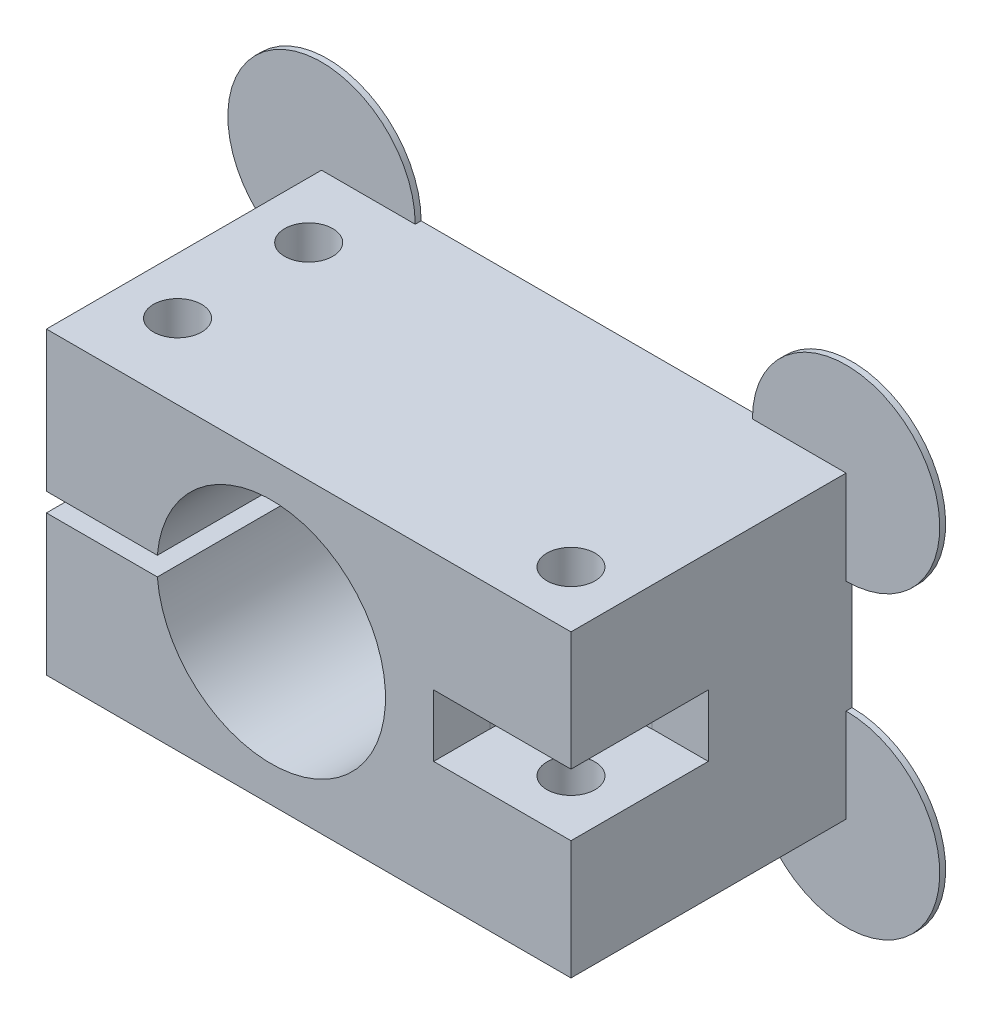
ISO-10303-21;
HEADER;
FILE_DESCRIPTION(('STEP AP214'),'2;1');
FILE_NAME('part.step','',(''),(''),'','','');
FILE_SCHEMA(('AUTOMOTIVE_DESIGN { 1 0 10303 214 1 1 1 1 }'));
ENDSEC;
DATA;
#1=APPLICATION_CONTEXT('core data for automotive mechanical design processes');
#2=APPLICATION_PROTOCOL_DEFINITION('international standard','automotive_design',2000,#1);
#3=PRODUCT_CONTEXT('',#1,'mechanical');
#4=PRODUCT('Part','Part','',(#3));
#5=PRODUCT_RELATED_PRODUCT_CATEGORY('part','',(#4));
#6=PRODUCT_DEFINITION_FORMATION('','',#4);
#7=PRODUCT_DEFINITION_CONTEXT('part definition',#1,'design');
#8=PRODUCT_DEFINITION('design','',#6,#7);
#9=PRODUCT_DEFINITION_SHAPE('','',#8);
#10=(LENGTH_UNIT() NAMED_UNIT(*) SI_UNIT(.MILLI.,.METRE.));
#11=(NAMED_UNIT(*) PLANE_ANGLE_UNIT() SI_UNIT($,.RADIAN.));
#12=(NAMED_UNIT(*) SI_UNIT($,.STERADIAN.) SOLID_ANGLE_UNIT());
#13=UNCERTAINTY_MEASURE_WITH_UNIT(LENGTH_MEASURE(1.E-05),#10,'distance_accuracy_value','');
#14=(GEOMETRIC_REPRESENTATION_CONTEXT(3) GLOBAL_UNCERTAINTY_ASSIGNED_CONTEXT((#13)) GLOBAL_UNIT_ASSIGNED_CONTEXT((#10,
#11,#12)) REPRESENTATION_CONTEXT('',''));
#15=CARTESIAN_POINT('',(0.,0.,0.));
#16=DIRECTION('',(0.,0.,1.));
#17=DIRECTION('',(1.,0.,0.));
#18=AXIS2_PLACEMENT_3D('',#15,#16,#17);
#19=CARTESIAN_POINT('',(20.32,-10.16,19.05));
#20=DIRECTION('',(-1.,0.,0.));
#21=DIRECTION('',(0.,0.,1.));
#22=AXIS2_PLACEMENT_3D('',#19,#20,#21);
#23=PLANE('',#22);
#24=DIRECTION('',(0.,1.,0.));
#25=VECTOR('',#24,1.);
#26=CARTESIAN_POINT('',(20.32,-10.16,0.));
#27=LINE('',#26,#25);
#28=CARTESIAN_POINT('',(20.32,-3.81,0.));
#29=VERTEX_POINT('',#28);
#30=CARTESIAN_POINT('',(20.32,3.80999999999999,0.));
#31=VERTEX_POINT('',#30);
#32=EDGE_CURVE('E186',#29,#31,#27,.T.);
#33=ORIENTED_EDGE('',*,*,#32,.T.);
#34=DIRECTION('',(0.,0.,-1.));
#35=VECTOR('',#34,1.);
#36=CARTESIAN_POINT('',(20.32,3.80999999999999,0.4));
#37=LINE('',#36,#35);
#38=CARTESIAN_POINT('',(20.32,3.80999999999999,0.400000000000001));
#39=VERTEX_POINT('',#38);
#40=EDGE_CURVE('E196',#31,#39,#37,.F.);
#41=ORIENTED_EDGE('',*,*,#40,.T.);
#42=DIRECTION('',(0.,-1.,0.));
#43=VECTOR('',#42,1.);
#44=CARTESIAN_POINT('',(20.32,-10.16,0.400000000000001));
#45=LINE('',#44,#43);
#46=CARTESIAN_POINT('',(20.32,10.16,0.400000000000008));
#47=VERTEX_POINT('',#46);
#48=EDGE_CURVE('E207',#47,#39,#45,.T.);
#49=ORIENTED_EDGE('',*,*,#48,.F.);
#50=DIRECTION('',(0.,0.,-1.));
#51=VECTOR('',#50,1.);
#52=CARTESIAN_POINT('',(20.32,10.16,19.05));
#53=LINE('',#52,#51);
#54=CARTESIAN_POINT('',(20.32,10.16,19.05));
#55=VERTEX_POINT('',#54);
#56=EDGE_CURVE('E338',#55,#47,#53,.T.);
#57=ORIENTED_EDGE('',*,*,#56,.F.);
#58=DIRECTION('',(0.,1.,0.));
#59=VECTOR('',#58,1.);
#60=CARTESIAN_POINT('',(20.32,-10.16,19.05));
#61=LINE('',#60,#59);
#62=CARTESIAN_POINT('',(20.32,2.1,19.05));
#63=VERTEX_POINT('',#62);
#64=EDGE_CURVE('E325',#63,#55,#61,.T.);
#65=ORIENTED_EDGE('',*,*,#64,.F.);
#66=DIRECTION('',(0.,0.,-1.));
#67=VECTOR('',#66,1.);
#68=CARTESIAN_POINT('',(20.32,2.1,19.05));
#69=LINE('',#68,#67);
#70=CARTESIAN_POINT('',(20.32,2.1,9.74));
#71=VERTEX_POINT('',#70);
#72=EDGE_CURVE('E286',#63,#71,#69,.T.);
#73=ORIENTED_EDGE('',*,*,#72,.T.);
#74=DIRECTION('',(0.,-1.,0.));
#75=VECTOR('',#74,1.);
#76=CARTESIAN_POINT('',(20.32,-10.16,9.74));
#77=LINE('',#76,#75);
#78=CARTESIAN_POINT('',(20.32,-2.1,9.74));
#79=VERTEX_POINT('',#78);
#80=EDGE_CURVE('E354',#71,#79,#77,.T.);
#81=ORIENTED_EDGE('',*,*,#80,.T.);
#82=DIRECTION('',(0.,0.,-1.));
#83=VECTOR('',#82,1.);
#84=CARTESIAN_POINT('',(20.32,-2.1,19.05));
#85=LINE('',#84,#83);
#86=CARTESIAN_POINT('',(20.32,-2.1,19.05));
#87=VERTEX_POINT('',#86);
#88=EDGE_CURVE('E290',#87,#79,#85,.T.);
#89=ORIENTED_EDGE('',*,*,#88,.F.);
#90=CARTESIAN_POINT('',(20.32,-10.16,19.05));
#91=VERTEX_POINT('',#90);
#92=EDGE_CURVE('E326',#91,#87,#61,.T.);
#93=ORIENTED_EDGE('',*,*,#92,.F.);
#94=DIRECTION('',(0.,0.,-1.));
#95=VECTOR('',#94,1.);
#96=CARTESIAN_POINT('',(20.32,-10.16,19.05));
#97=LINE('',#96,#95);
#98=CARTESIAN_POINT('',(20.32,-10.16,0.400000000000008));
#99=VERTEX_POINT('',#98);
#100=EDGE_CURVE('E340',#91,#99,#97,.T.);
#101=ORIENTED_EDGE('',*,*,#100,.T.);
#102=DIRECTION('',(0.,1.,0.));
#103=VECTOR('',#102,1.);
#104=CARTESIAN_POINT('',(20.32,-10.16,0.400000000000001));
#105=LINE('',#104,#103);
#106=CARTESIAN_POINT('',(20.32,-3.81,0.400000000000001));
#107=VERTEX_POINT('',#106);
#108=EDGE_CURVE('E220',#99,#107,#105,.T.);
#109=ORIENTED_EDGE('',*,*,#108,.T.);
#110=DIRECTION('',(0.,0.,-1.));
#111=VECTOR('',#110,1.);
#112=CARTESIAN_POINT('',(20.32,-3.81,0.4));
#113=LINE('',#112,#111);
#114=EDGE_CURVE('E218',#107,#29,#113,.T.);
#115=ORIENTED_EDGE('',*,*,#114,.T.);
#116=EDGE_LOOP('',(#33,#41,#49,#57,#65,#73,#81,#89,#93,#101,#109,#115));
#117=FACE_BOUND('',#116,.T.);
#118=ADVANCED_FACE('F33',(#117),#23,.F.);
#119=CARTESIAN_POINT('',(0.,0.,19.05));
#120=DIRECTION('',(0.,0.,-1.));
#121=DIRECTION('',(-1.,0.,0.));
#122=AXIS2_PLACEMENT_3D('',#119,#120,#121);
#123=PLANE('',#122);
#124=DIRECTION('',(1.,0.,0.));
#125=VECTOR('',#124,1.);
#126=CARTESIAN_POINT('',(0.,-2.1,19.05));
#127=LINE('',#126,#125);
#128=CARTESIAN_POINT('',(11.01,-2.1,19.05));
#129=VERTEX_POINT('',#128);
#130=EDGE_CURVE('E352',#129,#87,#127,.T.);
#131=ORIENTED_EDGE('',*,*,#130,.F.);
#132=DIRECTION('',(0.,1.,0.));
#133=VECTOR('',#132,1.);
#134=CARTESIAN_POINT('',(11.01,0.,19.05));
#135=LINE('',#134,#133);
#136=CARTESIAN_POINT('',(11.01,2.1,19.05));
#137=VERTEX_POINT('',#136);
#138=EDGE_CURVE('E349',#129,#137,#135,.T.);
#139=ORIENTED_EDGE('',*,*,#138,.T.);
#140=DIRECTION('',(1.,0.,0.));
#141=VECTOR('',#140,1.);
#142=CARTESIAN_POINT('',(0.,2.1,19.05));
#143=LINE('',#142,#141);
#144=EDGE_CURVE('E346',#137,#63,#143,.T.);
#145=ORIENTED_EDGE('',*,*,#144,.T.);
#146=ORIENTED_EDGE('',*,*,#64,.T.);
#147=DIRECTION('',(-1.,0.,0.));
#148=VECTOR('',#147,1.);
#149=CARTESIAN_POINT('',(-15.24,10.16,19.05));
#150=LINE('',#149,#148);
#151=CARTESIAN_POINT('',(-15.24,10.16,19.05));
#152=VERTEX_POINT('',#151);
#153=EDGE_CURVE('E329',#55,#152,#150,.T.);
#154=ORIENTED_EDGE('',*,*,#153,.T.);
#155=DIRECTION('',(0.,-1.,0.));
#156=VECTOR('',#155,1.);
#157=CARTESIAN_POINT('',(-15.24,-10.16,19.05));
#158=LINE('',#157,#156);
#159=CARTESIAN_POINT('',(-15.24,0.635,19.05));
#160=VERTEX_POINT('',#159);
#161=EDGE_CURVE('E320',#152,#160,#158,.T.);
#162=ORIENTED_EDGE('',*,*,#161,.T.);
#163=DIRECTION('',(-1.,0.,0.));
#164=VECTOR('',#163,1.);
#165=CARTESIAN_POINT('',(-15.2660684499861,0.635,19.05));
#166=LINE('',#165,#164);
#167=CARTESIAN_POINT('',(-7.7209315500139,0.635,19.05));
#168=VERTEX_POINT('',#167);
#169=EDGE_CURVE('E292',#168,#160,#166,.T.);
#170=ORIENTED_EDGE('',*,*,#169,.F.);
#171=CARTESIAN_POINT('',(0.,0.,19.05));
#172=DIRECTION('',(0.,0.,1.));
#173=DIRECTION('',(1.,0.,0.));
#174=AXIS2_PLACEMENT_3D('',#171,#172,#173);
#175=CIRCLE('',#174,7.747);
#176=CARTESIAN_POINT('',(-7.7209315500139,-0.635,19.05));
#177=VERTEX_POINT('',#176);
#178=EDGE_CURVE('E313',#177,#168,#175,.T.);
#179=ORIENTED_EDGE('',*,*,#178,.F.);
#180=DIRECTION('',(1.,0.,0.));
#181=VECTOR('',#180,1.);
#182=CARTESIAN_POINT('',(-15.2660684499861,-0.635,19.05));
#183=LINE('',#182,#181);
#184=CARTESIAN_POINT('',(-15.24,-0.635,19.05));
#185=VERTEX_POINT('',#184);
#186=EDGE_CURVE('E297',#185,#177,#183,.T.);
#187=ORIENTED_EDGE('',*,*,#186,.F.);
#188=CARTESIAN_POINT('',(-15.24,-10.16,19.05));
#189=VERTEX_POINT('',#188);
#190=EDGE_CURVE('E185',#185,#189,#158,.T.);
#191=ORIENTED_EDGE('',*,*,#190,.T.);
#192=DIRECTION('',(1.,0.,0.));
#193=VECTOR('',#192,1.);
#194=CARTESIAN_POINT('',(-15.24,-10.16,19.05));
#195=LINE('',#194,#193);
#196=EDGE_CURVE('E323',#189,#91,#195,.T.);
#197=ORIENTED_EDGE('',*,*,#196,.T.);
#198=ORIENTED_EDGE('',*,*,#92,.T.);
#199=EDGE_LOOP('',(#131,#139,#145,#146,#154,#162,#170,#179,#187,#191,#197,#198));
#200=FACE_BOUND('',#199,.T.);
#201=ADVANCED_FACE('F377',(#200),#123,.F.);
#202=CARTESIAN_POINT('',(-15.24,-10.16,19.05));
#203=DIRECTION('',(1.,0.,0.));
#204=DIRECTION('',(0.,0.,-1.));
#205=AXIS2_PLACEMENT_3D('',#202,#203,#204);
#206=PLANE('',#205);
#207=DIRECTION('',(0.,-1.,0.));
#208=VECTOR('',#207,1.);
#209=CARTESIAN_POINT('',(-15.24,-10.16,0.));
#210=LINE('',#209,#208);
#211=CARTESIAN_POINT('',(-15.24,-0.635,0.));
#212=VERTEX_POINT('',#211);
#213=CARTESIAN_POINT('',(-15.24,-3.81000000000001,0.));
#214=VERTEX_POINT('',#213);
#215=EDGE_CURVE('E317',#212,#214,#210,.T.);
#216=ORIENTED_EDGE('',*,*,#215,.T.);
#217=DIRECTION('',(0.,0.,-1.));
#218=VECTOR('',#217,1.);
#219=CARTESIAN_POINT('',(-15.24,-3.81000000000001,0.4));
#220=LINE('',#219,#218);
#221=CARTESIAN_POINT('',(-15.24,-3.81,0.400000000000001));
#222=VERTEX_POINT('',#221);
#223=EDGE_CURVE('E231',#214,#222,#220,.F.);
#224=ORIENTED_EDGE('',*,*,#223,.T.);
#225=DIRECTION('',(0.,1.,0.));
#226=VECTOR('',#225,1.);
#227=CARTESIAN_POINT('',(-15.24,-10.16,0.400000000000001));
#228=LINE('',#227,#226);
#229=CARTESIAN_POINT('',(-15.24,-10.16,0.400000000000008));
#230=VERTEX_POINT('',#229);
#231=EDGE_CURVE('E233',#230,#222,#228,.T.);
#232=ORIENTED_EDGE('',*,*,#231,.F.);
#233=DIRECTION('',(0.,0.,-1.));
#234=VECTOR('',#233,1.);
#235=CARTESIAN_POINT('',(-15.24,-10.16,19.05));
#236=LINE('',#235,#234);
#237=EDGE_CURVE('E343',#189,#230,#236,.T.);
#238=ORIENTED_EDGE('',*,*,#237,.F.);
#239=ORIENTED_EDGE('',*,*,#190,.F.);
#240=DIRECTION('',(0.,0.,-1.));
#241=VECTOR('',#240,1.);
#242=CARTESIAN_POINT('',(-15.24,-0.635,19.05));
#243=LINE('',#242,#241);
#244=EDGE_CURVE('E310',#185,#212,#243,.T.);
#245=ORIENTED_EDGE('',*,*,#244,.T.);
#246=EDGE_LOOP('',(#216,#224,#232,#238,#239,#245));
#247=FACE_BOUND('',#246,.T.);
#248=ADVANCED_FACE('F421',(#247),#206,.F.);
#249=DIRECTION('',(0.,-1.,0.));
#250=VECTOR('',#249,1.);
#251=CARTESIAN_POINT('',(-15.24,-10.16,0.400000000000001));
#252=LINE('',#251,#250);
#253=CARTESIAN_POINT('',(-15.24,10.16,0.400000000000008));
#254=VERTEX_POINT('',#253);
#255=CARTESIAN_POINT('',(-15.24,3.81,0.400000000000001));
#256=VERTEX_POINT('',#255);
#257=EDGE_CURVE('E48',#254,#256,#252,.T.);
#258=ORIENTED_EDGE('',*,*,#257,.T.);
#259=DIRECTION('',(0.,0.,-1.));
#260=VECTOR('',#259,1.);
#261=CARTESIAN_POINT('',(-15.24,3.81000000000001,0.4));
#262=LINE('',#261,#260);
#263=CARTESIAN_POINT('',(-15.24,3.81000000000001,0.));
#264=VERTEX_POINT('',#263);
#265=EDGE_CURVE('E203',#256,#264,#262,.T.);
#266=ORIENTED_EDGE('',*,*,#265,.T.);
#267=CARTESIAN_POINT('',(-15.24,0.635,0.));
#268=VERTEX_POINT('',#267);
#269=EDGE_CURVE('E332',#264,#268,#210,.T.);
#270=ORIENTED_EDGE('',*,*,#269,.T.);
#271=DIRECTION('',(0.,0.,1.));
#272=VECTOR('',#271,1.);
#273=CARTESIAN_POINT('',(-15.24,0.635,19.05));
#274=LINE('',#273,#272);
#275=EDGE_CURVE('E306',#268,#160,#274,.T.);
#276=ORIENTED_EDGE('',*,*,#275,.T.);
#277=ORIENTED_EDGE('',*,*,#161,.F.);
#278=DIRECTION('',(0.,0.,-1.));
#279=VECTOR('',#278,1.);
#280=CARTESIAN_POINT('',(-15.24,10.16,19.05));
#281=LINE('',#280,#279);
#282=EDGE_CURVE('E331',#152,#254,#281,.T.);
#283=ORIENTED_EDGE('',*,*,#282,.T.);
#284=EDGE_LOOP('',(#258,#266,#270,#276,#277,#283));
#285=FACE_BOUND('',#284,.T.);
#286=ADVANCED_FACE('F35',(#285),#206,.F.);
#287=CARTESIAN_POINT('',(-15.24,-10.16,19.05));
#288=DIRECTION('',(0.,1.,0.));
#289=DIRECTION('',(-1.,0.,0.));
#290=AXIS2_PLACEMENT_3D('',#287,#288,#289);
#291=PLANE('',#290);
#292=CARTESIAN_POINT('',(-11.43,-10.16,13.97));
#293=DIRECTION('',(0.,-1.,0.));
#294=DIRECTION('',(0.,0.,-1.));
#295=AXIS2_PLACEMENT_3D('',#292,#293,#294);
#296=CIRCLE('',#295,1.63195);
#297=CARTESIAN_POINT('',(-11.43,-10.16,12.33805));
#298=VERTEX_POINT('',#297);
#299=EDGE_CURVE('E236',#298,#298,#296,.T.);
#300=ORIENTED_EDGE('',*,*,#299,.F.);
#301=EDGE_LOOP('',(#300));
#302=FACE_BOUND('',#301,.T.);
#303=CARTESIAN_POINT('',(-11.43,-10.16,5.08));
#304=DIRECTION('',(0.,-1.,0.));
#305=DIRECTION('',(0.,0.,-1.));
#306=AXIS2_PLACEMENT_3D('',#303,#304,#305);
#307=CIRCLE('',#306,1.63195);
#308=CARTESIAN_POINT('',(-11.43,-10.16,3.44805));
#309=VERTEX_POINT('',#308);
#310=EDGE_CURVE('E246',#309,#309,#307,.T.);
#311=ORIENTED_EDGE('',*,*,#310,.F.);
#312=EDGE_LOOP('',(#311));
#313=FACE_BOUND('',#312,.T.);
#314=CARTESIAN_POINT('',(16.51,-10.16,15.24));
#315=DIRECTION('',(0.,-1.,0.));
#316=DIRECTION('',(0.,0.,-1.));
#317=AXIS2_PLACEMENT_3D('',#314,#315,#316);
#318=CIRCLE('',#317,1.63195);
#319=CARTESIAN_POINT('',(16.51,-10.16,13.60805));
#320=VERTEX_POINT('',#319);
#321=EDGE_CURVE('E256',#320,#320,#318,.T.);
#322=ORIENTED_EDGE('',*,*,#321,.F.);
#323=EDGE_LOOP('',(#322));
#324=FACE_BOUND('',#323,.T.);
#325=DIRECTION('',(1.,0.,0.));
#326=VECTOR('',#325,1.);
#327=CARTESIAN_POINT('',(-15.24,-10.16,0.));
#328=LINE('',#327,#326);
#329=CARTESIAN_POINT('',(-8.89,-10.16,0.));
#330=VERTEX_POINT('',#329);
#331=CARTESIAN_POINT('',(13.97,-10.16,0.));
#332=VERTEX_POINT('',#331);
#333=EDGE_CURVE('E334',#330,#332,#328,.T.);
#334=ORIENTED_EDGE('',*,*,#333,.T.);
#335=DIRECTION('',(0.,0.,-1.));
#336=VECTOR('',#335,1.);
#337=CARTESIAN_POINT('',(13.97,-10.16,0.4));
#338=LINE('',#337,#336);
#339=CARTESIAN_POINT('',(13.97,-10.16,0.4));
#340=VERTEX_POINT('',#339);
#341=EDGE_CURVE('E214',#332,#340,#338,.F.);
#342=ORIENTED_EDGE('',*,*,#341,.T.);
#343=DIRECTION('',(1.,0.,0.));
#344=VECTOR('',#343,1.);
#345=CARTESIAN_POINT('',(-15.24,-10.16,0.400000000000001));
#346=LINE('',#345,#344);
#347=EDGE_CURVE('E366',#340,#99,#346,.T.);
#348=ORIENTED_EDGE('',*,*,#347,.T.);
#349=ORIENTED_EDGE('',*,*,#100,.F.);
#350=ORIENTED_EDGE('',*,*,#196,.F.);
#351=ORIENTED_EDGE('',*,*,#237,.T.);
#352=DIRECTION('',(-1.,0.,0.));
#353=VECTOR('',#352,1.);
#354=CARTESIAN_POINT('',(-15.24,-10.16,0.400000000000001));
#355=LINE('',#354,#353);
#356=CARTESIAN_POINT('',(-8.89,-10.16,0.4));
#357=VERTEX_POINT('',#356);
#358=EDGE_CURVE('E357',#357,#230,#355,.T.);
#359=ORIENTED_EDGE('',*,*,#358,.F.);
#360=DIRECTION('',(0.,0.,-1.));
#361=VECTOR('',#360,1.);
#362=CARTESIAN_POINT('',(-8.89,-10.16,0.4));
#363=LINE('',#362,#361);
#364=EDGE_CURVE('E226',#357,#330,#363,.T.);
#365=ORIENTED_EDGE('',*,*,#364,.T.);
#366=EDGE_LOOP('',(#334,#342,#348,#349,#350,#351,#359,#365));
#367=FACE_BOUND('',#366,.T.);
#368=ADVANCED_FACE('F402',(#302,#313,#324,#367),#291,.F.);
#369=CARTESIAN_POINT('',(-15.24,10.16,19.05));
#370=DIRECTION('',(0.,-1.,0.));
#371=DIRECTION('',(1.,0.,0.));
#372=AXIS2_PLACEMENT_3D('',#369,#370,#371);
#373=PLANE('',#372);
#374=CARTESIAN_POINT('',(-11.43,10.16,13.97));
#375=DIRECTION('',(0.,-1.,0.));
#376=DIRECTION('',(0.,0.,-1.));
#377=AXIS2_PLACEMENT_3D('',#374,#375,#376);
#378=CIRCLE('',#377,1.63194999999999);
#379=CARTESIAN_POINT('',(-11.43,10.16,12.33805));
#380=VERTEX_POINT('',#379);
#381=EDGE_CURVE('E239',#380,#380,#378,.T.);
#382=ORIENTED_EDGE('',*,*,#381,.T.);
#383=EDGE_LOOP('',(#382));
#384=FACE_BOUND('',#383,.T.);
#385=CARTESIAN_POINT('',(-11.43,10.16,5.08));
#386=DIRECTION('',(0.,-1.,0.));
#387=DIRECTION('',(0.,0.,-1.));
#388=AXIS2_PLACEMENT_3D('',#385,#386,#387);
#389=CIRCLE('',#388,1.63194999999999);
#390=CARTESIAN_POINT('',(-11.43,10.16,3.44805000000001));
#391=VERTEX_POINT('',#390);
#392=EDGE_CURVE('E249',#391,#391,#389,.T.);
#393=ORIENTED_EDGE('',*,*,#392,.T.);
#394=EDGE_LOOP('',(#393));
#395=FACE_BOUND('',#394,.T.);
#396=CARTESIAN_POINT('',(16.51,10.16,15.24));
#397=DIRECTION('',(0.,-1.,0.));
#398=DIRECTION('',(0.,0.,-1.));
#399=AXIS2_PLACEMENT_3D('',#396,#397,#398);
#400=CIRCLE('',#399,1.63194999999999);
#401=CARTESIAN_POINT('',(16.51,10.16,13.60805));
#402=VERTEX_POINT('',#401);
#403=EDGE_CURVE('E259',#402,#402,#400,.T.);
#404=ORIENTED_EDGE('',*,*,#403,.T.);
#405=EDGE_LOOP('',(#404));
#406=FACE_BOUND('',#405,.T.);
#407=DIRECTION('',(-1.,0.,0.));
#408=VECTOR('',#407,1.);
#409=CARTESIAN_POINT('',(-15.24,10.16,0.));
#410=LINE('',#409,#408);
#411=CARTESIAN_POINT('',(13.97,10.16,0.));
#412=VERTEX_POINT('',#411);
#413=CARTESIAN_POINT('',(-8.89,10.16,0.));
#414=VERTEX_POINT('',#413);
#415=EDGE_CURVE('E176',#412,#414,#410,.T.);
#416=ORIENTED_EDGE('',*,*,#415,.T.);
#417=DIRECTION('',(0.,0.,-1.));
#418=VECTOR('',#417,1.);
#419=CARTESIAN_POINT('',(-8.89,10.16,0.4));
#420=LINE('',#419,#418);
#421=CARTESIAN_POINT('',(-8.89,10.16,0.4));
#422=VERTEX_POINT('',#421);
#423=EDGE_CURVE('E55',#414,#422,#420,.F.);
#424=ORIENTED_EDGE('',*,*,#423,.T.);
#425=DIRECTION('',(-1.,0.,0.));
#426=VECTOR('',#425,1.);
#427=CARTESIAN_POINT('',(-15.24,10.16,0.400000000000001));
#428=LINE('',#427,#426);
#429=EDGE_CURVE('E11',#422,#254,#428,.T.);
#430=ORIENTED_EDGE('',*,*,#429,.T.);
#431=ORIENTED_EDGE('',*,*,#282,.F.);
#432=ORIENTED_EDGE('',*,*,#153,.F.);
#433=ORIENTED_EDGE('',*,*,#56,.T.);
#434=DIRECTION('',(1.,0.,0.));
#435=VECTOR('',#434,1.);
#436=CARTESIAN_POINT('',(-15.24,10.16,0.400000000000001));
#437=LINE('',#436,#435);
#438=CARTESIAN_POINT('',(13.97,10.16,0.4));
#439=VERTEX_POINT('',#438);
#440=EDGE_CURVE('E41',#439,#47,#437,.T.);
#441=ORIENTED_EDGE('',*,*,#440,.F.);
#442=DIRECTION('',(0.,0.,-1.));
#443=VECTOR('',#442,1.);
#444=CARTESIAN_POINT('',(13.97,10.16,0.4));
#445=LINE('',#444,#443);
#446=EDGE_CURVE('E189',#439,#412,#445,.T.);
#447=ORIENTED_EDGE('',*,*,#446,.T.);
#448=EDGE_LOOP('',(#416,#424,#430,#431,#432,#433,#441,#447));
#449=FACE_BOUND('',#448,.T.);
#450=ADVANCED_FACE('F190',(#384,#395,#406,#449),#373,.F.);
#451=CARTESIAN_POINT('',(0.,0.,0.));
#452=DIRECTION('',(0.,0.,-1.));
#453=DIRECTION('',(-1.,0.,0.));
#454=AXIS2_PLACEMENT_3D('',#451,#452,#453);
#455=PLANE('',#454);
#456=ORIENTED_EDGE('',*,*,#269,.F.);
#457=CARTESIAN_POINT('',(-15.24,10.16,0.));
#458=DIRECTION('',(0.,0.,-1.));
#459=DIRECTION('',(1.,0.,0.));
#460=AXIS2_PLACEMENT_3D('',#457,#458,#459);
#461=CIRCLE('',#460,6.35);
#462=EDGE_CURVE('E184',#264,#414,#461,.T.);
#463=ORIENTED_EDGE('',*,*,#462,.T.);
#464=ORIENTED_EDGE('',*,*,#415,.F.);
#465=CARTESIAN_POINT('',(20.32,10.16,0.));
#466=DIRECTION('',(0.,0.,-1.));
#467=DIRECTION('',(-1.,0.,0.));
#468=AXIS2_PLACEMENT_3D('',#465,#466,#467);
#469=CIRCLE('',#468,6.35000000000001);
#470=EDGE_CURVE('E182',#412,#31,#469,.T.);
#471=ORIENTED_EDGE('',*,*,#470,.T.);
#472=ORIENTED_EDGE('',*,*,#32,.F.);
#473=CARTESIAN_POINT('',(20.32,-10.16,0.));
#474=DIRECTION('',(0.,0.,-1.));
#475=DIRECTION('',(1.,0.,0.));
#476=AXIS2_PLACEMENT_3D('',#473,#474,#475);
#477=CIRCLE('',#476,6.35000000000001);
#478=EDGE_CURVE('E210',#29,#332,#477,.T.);
#479=ORIENTED_EDGE('',*,*,#478,.T.);
#480=ORIENTED_EDGE('',*,*,#333,.F.);
#481=CARTESIAN_POINT('',(-15.24,-10.16,0.));
#482=DIRECTION('',(0.,0.,-1.));
#483=DIRECTION('',(-1.,0.,0.));
#484=AXIS2_PLACEMENT_3D('',#481,#482,#483);
#485=CIRCLE('',#484,6.35);
#486=EDGE_CURVE('E222',#330,#214,#485,.T.);
#487=ORIENTED_EDGE('',*,*,#486,.T.);
#488=ORIENTED_EDGE('',*,*,#215,.F.);
#489=DIRECTION('',(1.,0.,0.));
#490=VECTOR('',#489,1.);
#491=CARTESIAN_POINT('',(-15.2660684499861,-0.635,0.));
#492=LINE('',#491,#490);
#493=CARTESIAN_POINT('',(-7.7209315500139,-0.635,0.));
#494=VERTEX_POINT('',#493);
#495=EDGE_CURVE('E296',#212,#494,#492,.T.);
#496=ORIENTED_EDGE('',*,*,#495,.T.);
#497=CARTESIAN_POINT('',(0.,0.,0.));
#498=DIRECTION('',(0.,0.,1.));
#499=DIRECTION('',(1.,0.,0.));
#500=AXIS2_PLACEMENT_3D('',#497,#498,#499);
#501=CIRCLE('',#500,7.747);
#502=CARTESIAN_POINT('',(-7.7209315500139,0.635,0.));
#503=VERTEX_POINT('',#502);
#504=EDGE_CURVE('E314',#494,#503,#501,.T.);
#505=ORIENTED_EDGE('',*,*,#504,.T.);
#506=DIRECTION('',(-1.,0.,0.));
#507=VECTOR('',#506,1.);
#508=CARTESIAN_POINT('',(-15.2660684499861,0.635,0.));
#509=LINE('',#508,#507);
#510=EDGE_CURVE('E293',#503,#268,#509,.T.);
#511=ORIENTED_EDGE('',*,*,#510,.T.);
#512=EDGE_LOOP('',(#456,#463,#464,#471,#472,#479,#480,#487,#488,#496,#505,#511));
#513=FACE_BOUND('',#512,.T.);
#514=ADVANCED_FACE('F179',(#513),#455,.T.);
#515=CARTESIAN_POINT('',(0.,0.,0.));
#516=DIRECTION('',(0.,0.,1.));
#517=DIRECTION('',(1.,0.,0.));
#518=AXIS2_PLACEMENT_3D('',#515,#516,#517);
#519=CYLINDRICAL_SURFACE('',#518,7.747);
#520=ORIENTED_EDGE('',*,*,#504,.F.);
#521=DIRECTION('',(0.,0.,1.));
#522=VECTOR('',#521,1.);
#523=CARTESIAN_POINT('',(-7.7209315500139,-0.635,0.));
#524=LINE('',#523,#522);
#525=EDGE_CURVE('E303',#494,#177,#524,.T.);
#526=ORIENTED_EDGE('',*,*,#525,.T.);
#527=ORIENTED_EDGE('',*,*,#178,.T.);
#528=DIRECTION('',(0.,0.,1.));
#529=VECTOR('',#528,1.);
#530=CARTESIAN_POINT('',(-7.7209315500139,0.635,0.));
#531=LINE('',#530,#529);
#532=EDGE_CURVE('E300',#503,#168,#531,.T.);
#533=ORIENTED_EDGE('',*,*,#532,.F.);
#534=EDGE_LOOP('',(#520,#526,#527,#533));
#535=FACE_BOUND('',#534,.T.);
#536=ADVANCED_FACE('F493',(#535),#519,.F.);
#537=CARTESIAN_POINT('',(-15.2660684499861,0.635,0.));
#538=DIRECTION('',(0.,1.,0.));
#539=DIRECTION('',(0.,0.,1.));
#540=AXIS2_PLACEMENT_3D('',#537,#538,#539);
#541=PLANE('',#540);
#542=CARTESIAN_POINT('',(-11.43,0.635,13.97));
#543=DIRECTION('',(0.,1.,0.));
#544=DIRECTION('',(0.,0.,1.));
#545=AXIS2_PLACEMENT_3D('',#542,#543,#544);
#546=CIRCLE('',#545,1.63195);
#547=CARTESIAN_POINT('',(-11.43,0.635,15.60195));
#548=VERTEX_POINT('',#547);
#549=EDGE_CURVE('E243',#548,#548,#546,.T.);
#550=ORIENTED_EDGE('',*,*,#549,.T.);
#551=EDGE_LOOP('',(#550));
#552=FACE_BOUND('',#551,.T.);
#553=CARTESIAN_POINT('',(-11.43,0.635,5.08));
#554=DIRECTION('',(0.,1.,0.));
#555=DIRECTION('',(0.,0.,1.));
#556=AXIS2_PLACEMENT_3D('',#553,#554,#555);
#557=CIRCLE('',#556,1.63195);
#558=CARTESIAN_POINT('',(-11.43,0.635,6.71195));
#559=VERTEX_POINT('',#558);
#560=EDGE_CURVE('E253',#559,#559,#557,.T.);
#561=ORIENTED_EDGE('',*,*,#560,.T.);
#562=EDGE_LOOP('',(#561));
#563=FACE_BOUND('',#562,.T.);
#564=ORIENTED_EDGE('',*,*,#510,.F.);
#565=ORIENTED_EDGE('',*,*,#532,.T.);
#566=ORIENTED_EDGE('',*,*,#169,.T.);
#567=ORIENTED_EDGE('',*,*,#275,.F.);
#568=EDGE_LOOP('',(#564,#565,#566,#567));
#569=FACE_BOUND('',#568,.T.);
#570=ADVANCED_FACE('F489',(#552,#563,#569),#541,.F.);
#571=CARTESIAN_POINT('',(-15.2660684499861,-0.635,0.));
#572=DIRECTION('',(0.,-1.,0.));
#573=DIRECTION('',(0.,0.,-1.));
#574=AXIS2_PLACEMENT_3D('',#571,#572,#573);
#575=PLANE('',#574);
#576=CARTESIAN_POINT('',(-11.43,-0.635,13.97));
#577=DIRECTION('',(0.,-1.,0.));
#578=DIRECTION('',(0.,0.,-1.));
#579=AXIS2_PLACEMENT_3D('',#576,#577,#578);
#580=CIRCLE('',#579,1.63195);
#581=CARTESIAN_POINT('',(-11.43,-0.635,12.33805));
#582=VERTEX_POINT('',#581);
#583=EDGE_CURVE('E242',#582,#582,#580,.T.);
#584=ORIENTED_EDGE('',*,*,#583,.T.);
#585=EDGE_LOOP('',(#584));
#586=FACE_BOUND('',#585,.T.);
#587=CARTESIAN_POINT('',(-11.43,-0.635,5.08));
#588=DIRECTION('',(0.,-1.,0.));
#589=DIRECTION('',(0.,0.,-1.));
#590=AXIS2_PLACEMENT_3D('',#587,#588,#589);
#591=CIRCLE('',#590,1.63195);
#592=CARTESIAN_POINT('',(-11.43,-0.635,3.44805));
#593=VERTEX_POINT('',#592);
#594=EDGE_CURVE('E252',#593,#593,#591,.T.);
#595=ORIENTED_EDGE('',*,*,#594,.T.);
#596=EDGE_LOOP('',(#595));
#597=FACE_BOUND('',#596,.T.);
#598=ORIENTED_EDGE('',*,*,#186,.T.);
#599=ORIENTED_EDGE('',*,*,#525,.F.);
#600=ORIENTED_EDGE('',*,*,#495,.F.);
#601=ORIENTED_EDGE('',*,*,#244,.F.);
#602=EDGE_LOOP('',(#598,#599,#600,#601));
#603=FACE_BOUND('',#602,.T.);
#604=ADVANCED_FACE('F481',(#586,#597,#603),#575,.F.);
#605=CARTESIAN_POINT('',(22.01,-2.1,9.74));
#606=DIRECTION('',(0.,0.,-1.));
#607=DIRECTION('',(-1.,0.,0.));
#608=AXIS2_PLACEMENT_3D('',#605,#606,#607);
#609=PLANE('',#608);
#610=DIRECTION('',(-1.,0.,0.));
#611=VECTOR('',#610,1.);
#612=CARTESIAN_POINT('',(22.01,2.1,9.74));
#613=LINE('',#612,#611);
#614=CARTESIAN_POINT('',(16.51,2.1,9.74));
#615=VERTEX_POINT('',#614);
#616=EDGE_CURVE('E271',#71,#615,#613,.T.);
#617=ORIENTED_EDGE('',*,*,#616,.T.);
#618=DIRECTION('',(0.,1.,0.));
#619=VECTOR('',#618,1.);
#620=CARTESIAN_POINT('',(16.51,-2.1,9.74));
#621=LINE('',#620,#619);
#622=CARTESIAN_POINT('',(16.51,-2.1,9.74));
#623=VERTEX_POINT('',#622);
#624=EDGE_CURVE('E283',#623,#615,#621,.T.);
#625=ORIENTED_EDGE('',*,*,#624,.F.);
#626=DIRECTION('',(-1.,0.,0.));
#627=VECTOR('',#626,1.);
#628=CARTESIAN_POINT('',(22.01,-2.1,9.74));
#629=LINE('',#628,#627);
#630=EDGE_CURVE('E274',#79,#623,#629,.T.);
#631=ORIENTED_EDGE('',*,*,#630,.F.);
#632=ORIENTED_EDGE('',*,*,#80,.F.);
#633=EDGE_LOOP('',(#617,#625,#631,#632));
#634=FACE_BOUND('',#633,.T.);
#635=ADVANCED_FACE('F387',(#634),#609,.F.);
#636=CARTESIAN_POINT('',(11.01,-2.1,15.24));
#637=DIRECTION('',(-1.,0.,0.));
#638=DIRECTION('',(0.,0.,1.));
#639=AXIS2_PLACEMENT_3D('',#636,#637,#638);
#640=PLANE('',#639);
#641=DIRECTION('',(0.,0.,1.));
#642=VECTOR('',#641,1.);
#643=CARTESIAN_POINT('',(11.01,-2.1,15.24));
#644=LINE('',#643,#642);
#645=CARTESIAN_POINT('',(11.01,-2.1,15.24));
#646=VERTEX_POINT('',#645);
#647=EDGE_CURVE('E270',#646,#129,#644,.T.);
#648=ORIENTED_EDGE('',*,*,#647,.F.);
#649=DIRECTION('',(0.,1.,0.));
#650=VECTOR('',#649,1.);
#651=CARTESIAN_POINT('',(11.01,-2.1,15.24));
#652=LINE('',#651,#650);
#653=CARTESIAN_POINT('',(11.01,2.1,15.24));
#654=VERTEX_POINT('',#653);
#655=EDGE_CURVE('E276',#646,#654,#652,.T.);
#656=ORIENTED_EDGE('',*,*,#655,.T.);
#657=DIRECTION('',(0.,0.,1.));
#658=VECTOR('',#657,1.);
#659=CARTESIAN_POINT('',(11.01,2.1,15.24));
#660=LINE('',#659,#658);
#661=EDGE_CURVE('E279',#654,#137,#660,.T.);
#662=ORIENTED_EDGE('',*,*,#661,.T.);
#663=ORIENTED_EDGE('',*,*,#138,.F.);
#664=EDGE_LOOP('',(#648,#656,#662,#663));
#665=FACE_BOUND('',#664,.T.);
#666=ADVANCED_FACE('F474',(#665),#640,.F.);
#667=CARTESIAN_POINT('',(16.51,-2.1,15.24));
#668=DIRECTION('',(0.,1.,0.));
#669=DIRECTION('',(0.,0.,1.));
#670=AXIS2_PLACEMENT_3D('',#667,#668,#669);
#671=PLANE('',#670);
#672=CARTESIAN_POINT('',(16.51,-2.1,15.24));
#673=DIRECTION('',(0.,1.,0.));
#674=DIRECTION('',(0.,0.,1.));
#675=AXIS2_PLACEMENT_3D('',#672,#673,#674);
#676=CIRCLE('',#675,1.63194999999999);
#677=CARTESIAN_POINT('',(16.51,-2.1,16.87195));
#678=VERTEX_POINT('',#677);
#679=EDGE_CURVE('E263',#678,#678,#676,.T.);
#680=ORIENTED_EDGE('',*,*,#679,.F.);
#681=EDGE_LOOP('',(#680));
#682=FACE_BOUND('',#681,.T.);
#683=ORIENTED_EDGE('',*,*,#88,.T.);
#684=ORIENTED_EDGE('',*,*,#630,.T.);
#685=CARTESIAN_POINT('',(16.51,-2.1,15.24));
#686=DIRECTION('',(0.,1.,0.));
#687=DIRECTION('',(0.,0.,1.));
#688=AXIS2_PLACEMENT_3D('',#685,#686,#687);
#689=CIRCLE('',#688,5.5);
#690=EDGE_CURVE('E267',#623,#646,#689,.T.);
#691=ORIENTED_EDGE('',*,*,#690,.T.);
#692=ORIENTED_EDGE('',*,*,#647,.T.);
#693=ORIENTED_EDGE('',*,*,#130,.T.);
#694=EDGE_LOOP('',(#683,#684,#691,#692,#693));
#695=FACE_BOUND('',#694,.T.);
#696=ADVANCED_FACE('F394',(#682,#695),#671,.T.);
#697=CARTESIAN_POINT('',(16.51,2.1,15.24));
#698=DIRECTION('',(0.,1.,0.));
#699=DIRECTION('',(0.,0.,1.));
#700=AXIS2_PLACEMENT_3D('',#697,#698,#699);
#701=PLANE('',#700);
#702=CARTESIAN_POINT('',(16.51,2.1,15.24));
#703=DIRECTION('',(0.,1.,0.));
#704=DIRECTION('',(0.,0.,1.));
#705=AXIS2_PLACEMENT_3D('',#702,#703,#704);
#706=CIRCLE('',#705,1.63194999999999);
#707=CARTESIAN_POINT('',(16.51,2.1,16.87195));
#708=VERTEX_POINT('',#707);
#709=EDGE_CURVE('E262',#708,#708,#706,.T.);
#710=ORIENTED_EDGE('',*,*,#709,.T.);
#711=EDGE_LOOP('',(#710));
#712=FACE_BOUND('',#711,.T.);
#713=ORIENTED_EDGE('',*,*,#144,.F.);
#714=ORIENTED_EDGE('',*,*,#661,.F.);
#715=CARTESIAN_POINT('',(16.51,2.1,15.24));
#716=DIRECTION('',(0.,1.,0.));
#717=DIRECTION('',(0.,0.,1.));
#718=AXIS2_PLACEMENT_3D('',#715,#716,#717);
#719=CIRCLE('',#718,5.5);
#720=EDGE_CURVE('E266',#615,#654,#719,.T.);
#721=ORIENTED_EDGE('',*,*,#720,.F.);
#722=ORIENTED_EDGE('',*,*,#616,.F.);
#723=ORIENTED_EDGE('',*,*,#72,.F.);
#724=EDGE_LOOP('',(#713,#714,#721,#722,#723));
#725=FACE_BOUND('',#724,.T.);
#726=ADVANCED_FACE('F382',(#712,#725),#701,.F.);
#727=CARTESIAN_POINT('',(16.51,-2.1,15.24));
#728=DIRECTION('',(0.,1.,0.));
#729=DIRECTION('',(0.,0.,1.));
#730=AXIS2_PLACEMENT_3D('',#727,#728,#729);
#731=CYLINDRICAL_SURFACE('',#730,5.5);
#732=ORIENTED_EDGE('',*,*,#720,.T.);
#733=ORIENTED_EDGE('',*,*,#655,.F.);
#734=ORIENTED_EDGE('',*,*,#690,.F.);
#735=ORIENTED_EDGE('',*,*,#624,.T.);
#736=EDGE_LOOP('',(#732,#733,#734,#735));
#737=FACE_BOUND('',#736,.T.);
#738=ADVANCED_FACE('F391',(#737),#731,.F.);
#739=CARTESIAN_POINT('',(16.51,-10.16,15.24));
#740=DIRECTION('',(0.,-1.,0.));
#741=DIRECTION('',(0.,0.,-1.));
#742=AXIS2_PLACEMENT_3D('',#739,#740,#741);
#743=CYLINDRICAL_SURFACE('',#742,1.63194999999999);
#744=ORIENTED_EDGE('',*,*,#403,.F.);
#745=EDGE_LOOP('',(#744));
#746=FACE_BOUND('',#745,.T.);
#747=ORIENTED_EDGE('',*,*,#709,.F.);
#748=EDGE_LOOP('',(#747));
#749=FACE_BOUND('',#748,.T.);
#750=ADVANCED_FACE('F460',(#746,#749),#743,.F.);
#751=ORIENTED_EDGE('',*,*,#679,.T.);
#752=EDGE_LOOP('',(#751));
#753=FACE_BOUND('',#752,.T.);
#754=ORIENTED_EDGE('',*,*,#321,.T.);
#755=EDGE_LOOP('',(#754));
#756=FACE_BOUND('',#755,.T.);
#757=ADVANCED_FACE('F457',(#753,#756),#743,.F.);
#758=CARTESIAN_POINT('',(-11.43,-10.16,5.08));
#759=DIRECTION('',(0.,-1.,0.));
#760=DIRECTION('',(0.,0.,-1.));
#761=AXIS2_PLACEMENT_3D('',#758,#759,#760);
#762=CYLINDRICAL_SURFACE('',#761,1.63195);
#763=ORIENTED_EDGE('',*,*,#310,.T.);
#764=EDGE_LOOP('',(#763));
#765=FACE_BOUND('',#764,.T.);
#766=ORIENTED_EDGE('',*,*,#594,.F.);
#767=EDGE_LOOP('',(#766));
#768=FACE_BOUND('',#767,.T.);
#769=ADVANCED_FACE('F459',(#765,#768),#762,.F.);
#770=ORIENTED_EDGE('',*,*,#392,.F.);
#771=EDGE_LOOP('',(#770));
#772=FACE_BOUND('',#771,.T.);
#773=ORIENTED_EDGE('',*,*,#560,.F.);
#774=EDGE_LOOP('',(#773));
#775=FACE_BOUND('',#774,.T.);
#776=ADVANCED_FACE('F467',(#772,#775),#762,.F.);
#777=CARTESIAN_POINT('',(-11.43,-10.16,13.97));
#778=DIRECTION('',(0.,-1.,0.));
#779=DIRECTION('',(0.,0.,-1.));
#780=AXIS2_PLACEMENT_3D('',#777,#778,#779);
#781=CYLINDRICAL_SURFACE('',#780,1.63195);
#782=ORIENTED_EDGE('',*,*,#299,.T.);
#783=EDGE_LOOP('',(#782));
#784=FACE_BOUND('',#783,.T.);
#785=ORIENTED_EDGE('',*,*,#583,.F.);
#786=EDGE_LOOP('',(#785));
#787=FACE_BOUND('',#786,.T.);
#788=ADVANCED_FACE('F432',(#784,#787),#781,.F.);
#789=ORIENTED_EDGE('',*,*,#381,.F.);
#790=EDGE_LOOP('',(#789));
#791=FACE_BOUND('',#790,.T.);
#792=ORIENTED_EDGE('',*,*,#549,.F.);
#793=EDGE_LOOP('',(#792));
#794=FACE_BOUND('',#793,.T.);
#795=ADVANCED_FACE('F425',(#791,#794),#781,.F.);
#796=CARTESIAN_POINT('',(-15.24,-10.16,0.4));
#797=DIRECTION('',(0.,0.,-1.));
#798=DIRECTION('',(-1.,0.,0.));
#799=AXIS2_PLACEMENT_3D('',#796,#797,#798);
#800=PLANE('',#799);
#801=ORIENTED_EDGE('',*,*,#358,.T.);
#802=ORIENTED_EDGE('',*,*,#231,.T.);
#803=CARTESIAN_POINT('',(-15.24,-10.16,0.4));
#804=DIRECTION('',(0.,0.,-1.));
#805=DIRECTION('',(-1.,0.,0.));
#806=AXIS2_PLACEMENT_3D('',#803,#804,#805);
#807=CIRCLE('',#806,6.35);
#808=EDGE_CURVE('E223',#357,#222,#807,.T.);
#809=ORIENTED_EDGE('',*,*,#808,.F.);
#810=EDGE_LOOP('',(#801,#802,#809));
#811=FACE_BOUND('',#810,.T.);
#812=ADVANCED_FACE('F423',(#811),#800,.F.);
#813=CARTESIAN_POINT('',(-15.24,-10.16,0.4));
#814=DIRECTION('',(0.,0.,-1.));
#815=DIRECTION('',(-1.,0.,0.));
#816=AXIS2_PLACEMENT_3D('',#813,#814,#815);
#817=CYLINDRICAL_SURFACE('',#816,6.35);
#818=ORIENTED_EDGE('',*,*,#223,.F.);
#819=ORIENTED_EDGE('',*,*,#486,.F.);
#820=ORIENTED_EDGE('',*,*,#364,.F.);
#821=ORIENTED_EDGE('',*,*,#808,.T.);
#822=EDGE_LOOP('',(#818,#819,#820,#821));
#823=FACE_BOUND('',#822,.T.);
#824=ADVANCED_FACE('F419',(#823),#817,.T.);
#825=CARTESIAN_POINT('',(20.32,-10.16,0.4));
#826=DIRECTION('',(0.,0.,1.));
#827=DIRECTION('',(1.,0.,0.));
#828=AXIS2_PLACEMENT_3D('',#825,#826,#827);
#829=PLANE('',#828);
#830=ORIENTED_EDGE('',*,*,#108,.F.);
#831=ORIENTED_EDGE('',*,*,#347,.F.);
#832=CARTESIAN_POINT('',(20.32,-10.16,0.4));
#833=DIRECTION('',(0.,0.,-1.));
#834=DIRECTION('',(1.,0.,0.));
#835=AXIS2_PLACEMENT_3D('',#832,#833,#834);
#836=CIRCLE('',#835,6.35000000000001);
#837=EDGE_CURVE('E211',#107,#340,#836,.T.);
#838=ORIENTED_EDGE('',*,*,#837,.F.);
#839=EDGE_LOOP('',(#830,#831,#838));
#840=FACE_BOUND('',#839,.T.);
#841=ADVANCED_FACE('F408',(#840),#829,.T.);
#842=CARTESIAN_POINT('',(20.32,-10.16,0.4));
#843=DIRECTION('',(0.,0.,-1.));
#844=DIRECTION('',(-1.,0.,0.));
#845=AXIS2_PLACEMENT_3D('',#842,#843,#844);
#846=CYLINDRICAL_SURFACE('',#845,6.35000000000001);
#847=ORIENTED_EDGE('',*,*,#114,.F.);
#848=ORIENTED_EDGE('',*,*,#837,.T.);
#849=ORIENTED_EDGE('',*,*,#341,.F.);
#850=ORIENTED_EDGE('',*,*,#478,.F.);
#851=EDGE_LOOP('',(#847,#848,#849,#850));
#852=FACE_BOUND('',#851,.T.);
#853=ADVANCED_FACE('F411',(#852),#846,.T.);
#854=CARTESIAN_POINT('',(20.32,10.16,0.4));
#855=DIRECTION('',(0.,0.,-1.));
#856=DIRECTION('',(-1.,0.,0.));
#857=AXIS2_PLACEMENT_3D('',#854,#855,#856);
#858=PLANE('',#857);
#859=ORIENTED_EDGE('',*,*,#440,.T.);
#860=ORIENTED_EDGE('',*,*,#48,.T.);
#861=CARTESIAN_POINT('',(20.32,10.16,0.4));
#862=DIRECTION('',(0.,0.,-1.));
#863=DIRECTION('',(-1.,0.,0.));
#864=AXIS2_PLACEMENT_3D('',#861,#862,#863);
#865=CIRCLE('',#864,6.35000000000001);
#866=EDGE_CURVE('E197',#439,#39,#865,.T.);
#867=ORIENTED_EDGE('',*,*,#866,.F.);
#868=EDGE_LOOP('',(#859,#860,#867));
#869=FACE_BOUND('',#868,.T.);
#870=ADVANCED_FACE('F368',(#869),#858,.F.);
#871=CARTESIAN_POINT('',(20.32,10.16,0.4));
#872=DIRECTION('',(0.,0.,-1.));
#873=DIRECTION('',(-1.,0.,0.));
#874=AXIS2_PLACEMENT_3D('',#871,#872,#873);
#875=CYLINDRICAL_SURFACE('',#874,6.35000000000001);
#876=ORIENTED_EDGE('',*,*,#40,.F.);
#877=ORIENTED_EDGE('',*,*,#470,.F.);
#878=ORIENTED_EDGE('',*,*,#446,.F.);
#879=ORIENTED_EDGE('',*,*,#866,.T.);
#880=EDGE_LOOP('',(#876,#877,#878,#879));
#881=FACE_BOUND('',#880,.T.);
#882=ADVANCED_FACE('F200',(#881),#875,.T.);
#883=CARTESIAN_POINT('',(-15.24,10.16,0.4));
#884=DIRECTION('',(0.,0.,1.));
#885=DIRECTION('',(1.,0.,0.));
#886=AXIS2_PLACEMENT_3D('',#883,#884,#885);
#887=PLANE('',#886);
#888=ORIENTED_EDGE('',*,*,#257,.F.);
#889=ORIENTED_EDGE('',*,*,#429,.F.);
#890=CARTESIAN_POINT('',(-15.24,10.16,0.4));
#891=DIRECTION('',(0.,0.,-1.));
#892=DIRECTION('',(1.,0.,0.));
#893=AXIS2_PLACEMENT_3D('',#890,#891,#892);
#894=CIRCLE('',#893,6.35);
#895=EDGE_CURVE('E680',#256,#422,#894,.T.);
#896=ORIENTED_EDGE('',*,*,#895,.F.);
#897=EDGE_LOOP('',(#888,#889,#896));
#898=FACE_BOUND('',#897,.T.);
#899=ADVANCED_FACE('F652',(#898),#887,.T.);
#900=CARTESIAN_POINT('',(-15.24,10.16,0.4));
#901=DIRECTION('',(0.,0.,-1.));
#902=DIRECTION('',(-1.,0.,0.));
#903=AXIS2_PLACEMENT_3D('',#900,#901,#902);
#904=CYLINDRICAL_SURFACE('',#903,6.35);
#905=ORIENTED_EDGE('',*,*,#265,.F.);
#906=ORIENTED_EDGE('',*,*,#895,.T.);
#907=ORIENTED_EDGE('',*,*,#423,.F.);
#908=ORIENTED_EDGE('',*,*,#462,.F.);
#909=EDGE_LOOP('',(#905,#906,#907,#908));
#910=FACE_BOUND('',#909,.T.);
#911=ADVANCED_FACE('F660',(#910),#904,.T.);
#912=CLOSED_SHELL('',(#118,#201,#248,#286,#368,#450,#514,#536,#570,#604,#635,#666,#696,#726,
#738,#750,#757,#769,#776,#788,#795,#812,#824,#841,#853,#870,#882,#899,#911));
#913=MANIFOLD_SOLID_BREP('B2',#912);
#914=ADVANCED_BREP_SHAPE_REPRESENTATION('',(#18,#913),#14);
#915=SHAPE_DEFINITION_REPRESENTATION(#9,#914);
ENDSEC;
END-ISO-10303-21;
